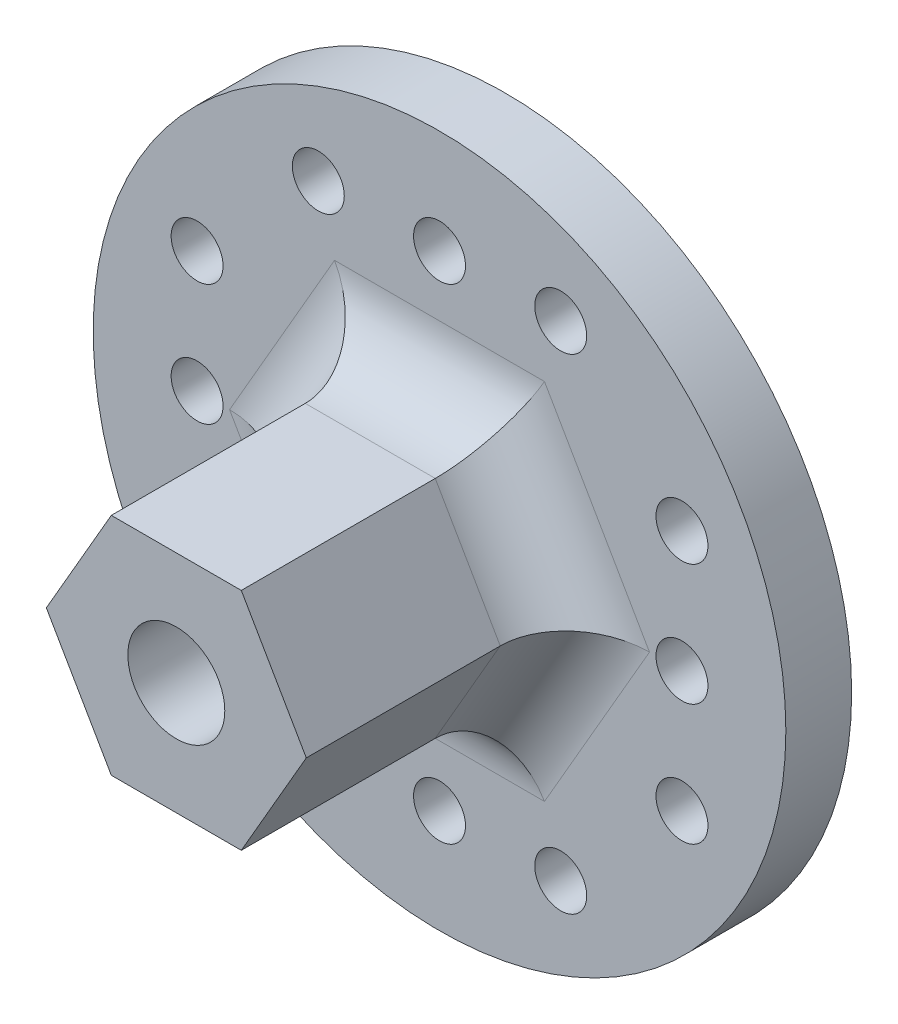
ISO-10303-21;
HEADER;
FILE_DESCRIPTION(('STEP AP214'),'2;1');
FILE_NAME('part.step','',(''),(''),'','','');
FILE_SCHEMA(('AUTOMOTIVE_DESIGN { 1 0 10303 214 1 1 1 1 }'));
ENDSEC;
DATA;
#1=APPLICATION_CONTEXT('core data for automotive mechanical design processes');
#2=APPLICATION_PROTOCOL_DEFINITION('international standard','automotive_design',2000,#1);
#3=PRODUCT_CONTEXT('',#1,'mechanical');
#4=PRODUCT('Part','Part','',(#3));
#5=PRODUCT_RELATED_PRODUCT_CATEGORY('part','',(#4));
#6=PRODUCT_DEFINITION_FORMATION('','',#4);
#7=PRODUCT_DEFINITION_CONTEXT('part definition',#1,'design');
#8=PRODUCT_DEFINITION('design','',#6,#7);
#9=PRODUCT_DEFINITION_SHAPE('','',#8);
#10=(LENGTH_UNIT() NAMED_UNIT(*) SI_UNIT(.MILLI.,.METRE.));
#11=(NAMED_UNIT(*) PLANE_ANGLE_UNIT() SI_UNIT($,.RADIAN.));
#12=(NAMED_UNIT(*) SI_UNIT($,.STERADIAN.) SOLID_ANGLE_UNIT());
#13=UNCERTAINTY_MEASURE_WITH_UNIT(LENGTH_MEASURE(1.E-05),#10,'distance_accuracy_value','');
#14=(GEOMETRIC_REPRESENTATION_CONTEXT(3) GLOBAL_UNCERTAINTY_ASSIGNED_CONTEXT((#13)) GLOBAL_UNIT_ASSIGNED_CONTEXT((#10,
#11,#12)) REPRESENTATION_CONTEXT('',''));
#15=CARTESIAN_POINT('',(0.,0.,0.));
#16=DIRECTION('',(0.,0.,1.));
#17=DIRECTION('',(1.,0.,0.));
#18=AXIS2_PLACEMENT_3D('',#15,#16,#17);
#19=CARTESIAN_POINT('',(0.,0.,1.9));
#20=DIRECTION('',(0.,0.,1.));
#21=DIRECTION('',(1.,0.,0.));
#22=AXIS2_PLACEMENT_3D('',#19,#20,#21);
#23=PLANE('',#22);
#24=DIRECTION('',(0.5,-0.866025403784439,0.));
#25=VECTOR('',#24,1.);
#26=CARTESIAN_POINT('',(-4.5466333698683,-2.625,1.9));
#27=LINE('',#26,#25);
#28=CARTESIAN_POINT('',(-3.03108891324553,-5.25,1.9));
#29=VERTEX_POINT('',#28);
#30=CARTESIAN_POINT('',(-6.06217782649107,0.,1.9));
#31=VERTEX_POINT('',#30);
#32=EDGE_CURVE('E223',#29,#31,#27,.F.);
#33=ORIENTED_EDGE('',*,*,#32,.T.);
#34=DIRECTION('',(-0.5,-0.866025403784439,0.));
#35=VECTOR('',#34,1.);
#36=CARTESIAN_POINT('',(-4.5466333698683,2.625,1.9));
#37=LINE('',#36,#35);
#38=CARTESIAN_POINT('',(-3.03108891324553,5.25,1.9));
#39=VERTEX_POINT('',#38);
#40=EDGE_CURVE('E225',#31,#39,#37,.F.);
#41=ORIENTED_EDGE('',*,*,#40,.T.);
#42=DIRECTION('',(-1.,0.,0.));
#43=VECTOR('',#42,1.);
#44=CARTESIAN_POINT('',(0.,5.25,1.9));
#45=LINE('',#44,#43);
#46=CARTESIAN_POINT('',(3.03108891324553,5.25,1.9));
#47=VERTEX_POINT('',#46);
#48=EDGE_CURVE('E215',#39,#47,#45,.F.);
#49=ORIENTED_EDGE('',*,*,#48,.T.);
#50=DIRECTION('',(-0.5,0.866025403784439,0.));
#51=VECTOR('',#50,1.);
#52=CARTESIAN_POINT('',(4.5466333698683,2.625,1.9));
#53=LINE('',#52,#51);
#54=CARTESIAN_POINT('',(6.06217782649107,0.,1.9));
#55=VERTEX_POINT('',#54);
#56=EDGE_CURVE('E217',#47,#55,#53,.F.);
#57=ORIENTED_EDGE('',*,*,#56,.T.);
#58=DIRECTION('',(0.5,0.866025403784439,0.));
#59=VECTOR('',#58,1.);
#60=CARTESIAN_POINT('',(4.5466333698683,-2.625,1.9));
#61=LINE('',#60,#59);
#62=CARTESIAN_POINT('',(3.03108891324554,-5.25,1.9));
#63=VERTEX_POINT('',#62);
#64=EDGE_CURVE('E219',#55,#63,#61,.F.);
#65=ORIENTED_EDGE('',*,*,#64,.T.);
#66=DIRECTION('',(1.,0.,0.));
#67=VECTOR('',#66,1.);
#68=CARTESIAN_POINT('',(0.,-5.25,1.9));
#69=LINE('',#68,#67);
#70=EDGE_CURVE('E221',#63,#29,#69,.F.);
#71=ORIENTED_EDGE('',*,*,#70,.T.);
#72=EDGE_LOOP('',(#33,#41,#49,#57,#65,#71));
#73=FACE_BOUND('',#72,.T.);
#74=CARTESIAN_POINT('',(3.5000000000003,-6.9999999999999,1.9));
#75=DIRECTION('',(0.,0.,1.));
#76=DIRECTION('',(1.,0.,0.));
#77=AXIS2_PLACEMENT_3D('',#74,#75,#76);
#78=CIRCLE('',#77,0.749999999999977);
#79=CARTESIAN_POINT('',(4.25000000000027,-6.9999999999999,1.9));
#80=VERTEX_POINT('',#79);
#81=EDGE_CURVE('E137',#80,#80,#78,.T.);
#82=ORIENTED_EDGE('',*,*,#81,.F.);
#83=EDGE_LOOP('',(#82));
#84=FACE_BOUND('',#83,.T.);
#85=CARTESIAN_POINT('',(-7.,-3.5,1.9));
#86=DIRECTION('',(0.,0.,1.));
#87=DIRECTION('',(1.,0.,0.));
#88=AXIS2_PLACEMENT_3D('',#85,#86,#87);
#89=CIRCLE('',#88,0.749999999999998);
#90=CARTESIAN_POINT('',(-6.25,-3.5,1.9));
#91=VERTEX_POINT('',#90);
#92=EDGE_CURVE('E149',#91,#91,#89,.T.);
#93=ORIENTED_EDGE('',*,*,#92,.F.);
#94=EDGE_LOOP('',(#93));
#95=FACE_BOUND('',#94,.T.);
#96=CARTESIAN_POINT('',(7.0000000000002,-3.49999999999961,1.9));
#97=DIRECTION('',(0.,0.,1.));
#98=DIRECTION('',(1.,0.,0.));
#99=AXIS2_PLACEMENT_3D('',#96,#97,#98);
#100=CIRCLE('',#99,0.750000000000342);
#101=CARTESIAN_POINT('',(7.75000000000054,-3.49999999999961,1.9));
#102=VERTEX_POINT('',#101);
#103=EDGE_CURVE('E161',#102,#102,#100,.T.);
#104=ORIENTED_EDGE('',*,*,#103,.F.);
#105=EDGE_LOOP('',(#104));
#106=FACE_BOUND('',#105,.T.);
#107=CARTESIAN_POINT('',(7.0000000000002,3.9377212006815E-13,1.9));
#108=DIRECTION('',(0.,0.,1.));
#109=DIRECTION('',(1.,0.,0.));
#110=AXIS2_PLACEMENT_3D('',#107,#108,#109);
#111=CIRCLE('',#110,0.750000000000319);
#112=CARTESIAN_POINT('',(7.75000000000052,3.9377212006815E-13,1.9));
#113=VERTEX_POINT('',#112);
#114=EDGE_CURVE('E173',#113,#113,#111,.T.);
#115=ORIENTED_EDGE('',*,*,#114,.F.);
#116=EDGE_LOOP('',(#115));
#117=FACE_BOUND('',#116,.T.);
#118=CARTESIAN_POINT('',(-3.5000000000001,7.00000000000029,1.9));
#119=DIRECTION('',(0.,0.,1.));
#120=DIRECTION('',(1.,0.,0.));
#121=AXIS2_PLACEMENT_3D('',#118,#119,#120);
#122=CIRCLE('',#121,0.750000000000305);
#123=CARTESIAN_POINT('',(-2.74999999999979,7.00000000000029,1.9));
#124=VERTEX_POINT('',#123);
#125=EDGE_CURVE('E185',#124,#124,#122,.T.);
#126=ORIENTED_EDGE('',*,*,#125,.F.);
#127=EDGE_LOOP('',(#126));
#128=FACE_BOUND('',#127,.T.);
#129=CARTESIAN_POINT('',(-7.,0.,1.9));
#130=DIRECTION('',(0.,0.,1.));
#131=DIRECTION('',(1.,0.,0.));
#132=AXIS2_PLACEMENT_3D('',#129,#130,#131);
#133=CIRCLE('',#132,0.749999999999998);
#134=CARTESIAN_POINT('',(-6.25,0.,1.9));
#135=VERTEX_POINT('',#134);
#136=EDGE_CURVE('E197',#135,#135,#133,.T.);
#137=ORIENTED_EDGE('',*,*,#136,.F.);
#138=EDGE_LOOP('',(#137));
#139=FACE_BOUND('',#138,.T.);
#140=CARTESIAN_POINT('',(0.,0.,1.9));
#141=DIRECTION('',(0.,0.,1.));
#142=DIRECTION('',(1.,0.,0.));
#143=AXIS2_PLACEMENT_3D('',#140,#141,#142);
#144=CIRCLE('',#143,9.99999999999866);
#145=CARTESIAN_POINT('',(9.99999999999866,0.,1.9));
#146=VERTEX_POINT('',#145);
#147=EDGE_CURVE('E203',#146,#146,#144,.T.);
#148=ORIENTED_EDGE('',*,*,#147,.T.);
#149=EDGE_LOOP('',(#148));
#150=FACE_BOUND('',#149,.T.);
#151=CARTESIAN_POINT('',(0.,7.0000000000003,1.9));
#152=DIRECTION('',(0.,0.,1.));
#153=DIRECTION('',(1.,0.,0.));
#154=AXIS2_PLACEMENT_3D('',#151,#152,#153);
#155=CIRCLE('',#154,0.750000000000317);
#156=CARTESIAN_POINT('',(0.75000000000022,7.0000000000003,1.9));
#157=VERTEX_POINT('',#156);
#158=EDGE_CURVE('E191',#157,#157,#155,.T.);
#159=ORIENTED_EDGE('',*,*,#158,.F.);
#160=EDGE_LOOP('',(#159));
#161=FACE_BOUND('',#160,.T.);
#162=CARTESIAN_POINT('',(3.4999999999999,7.0000000000003,1.9));
#163=DIRECTION('',(0.,0.,1.));
#164=DIRECTION('',(1.,0.,0.));
#165=AXIS2_PLACEMENT_3D('',#162,#163,#164);
#166=CIRCLE('',#165,0.750000000000329);
#167=CARTESIAN_POINT('',(4.25000000000023,7.0000000000003,1.9));
#168=VERTEX_POINT('',#167);
#169=EDGE_CURVE('E179',#168,#168,#166,.T.);
#170=ORIENTED_EDGE('',*,*,#169,.F.);
#171=EDGE_LOOP('',(#170));
#172=FACE_BOUND('',#171,.T.);
#173=CARTESIAN_POINT('',(7.0000000000002,3.50000000000039,1.9));
#174=DIRECTION('',(0.,0.,1.));
#175=DIRECTION('',(1.,0.,0.));
#176=AXIS2_PLACEMENT_3D('',#173,#174,#175);
#177=CIRCLE('',#176,0.750000000000295);
#178=CARTESIAN_POINT('',(7.75000000000049,3.50000000000039,1.9));
#179=VERTEX_POINT('',#178);
#180=EDGE_CURVE('E167',#179,#179,#177,.T.);
#181=ORIENTED_EDGE('',*,*,#180,.F.);
#182=EDGE_LOOP('',(#181));
#183=FACE_BOUND('',#182,.T.);
#184=CARTESIAN_POINT('',(2.97489912662145E-13,-6.9999999999999,1.9));
#185=DIRECTION('',(0.,0.,1.));
#186=DIRECTION('',(1.,0.,0.));
#187=AXIS2_PLACEMENT_3D('',#184,#185,#186);
#188=CIRCLE('',#187,0.750000000000013);
#189=CARTESIAN_POINT('',(0.750000000000311,-6.9999999999999,1.9));
#190=VERTEX_POINT('',#189);
#191=EDGE_CURVE('E155',#190,#190,#188,.T.);
#192=ORIENTED_EDGE('',*,*,#191,.F.);
#193=EDGE_LOOP('',(#192));
#194=FACE_BOUND('',#193,.T.);
#195=CARTESIAN_POINT('',(-7.,3.5,1.9));
#196=DIRECTION('',(0.,0.,1.));
#197=DIRECTION('',(1.,0.,0.));
#198=AXIS2_PLACEMENT_3D('',#195,#196,#197);
#199=CIRCLE('',#198,0.749999999999998);
#200=CARTESIAN_POINT('',(-6.25,3.5,1.9));
#201=VERTEX_POINT('',#200);
#202=EDGE_CURVE('E143',#201,#201,#199,.T.);
#203=ORIENTED_EDGE('',*,*,#202,.F.);
#204=EDGE_LOOP('',(#203));
#205=FACE_BOUND('',#204,.T.);
#206=CARTESIAN_POINT('',(-3.4999999999997,-6.9999999999999,1.9));
#207=DIRECTION('',(0.,0.,1.));
#208=DIRECTION('',(1.,0.,0.));
#209=AXIS2_PLACEMENT_3D('',#206,#207,#208);
#210=CIRCLE('',#209,0.750000000000049);
#211=CARTESIAN_POINT('',(-2.74999999999965,-6.9999999999999,1.9));
#212=VERTEX_POINT('',#211);
#213=EDGE_CURVE('E128',#212,#212,#210,.T.);
#214=ORIENTED_EDGE('',*,*,#213,.F.);
#215=EDGE_LOOP('',(#214));
#216=FACE_BOUND('',#215,.T.);
#217=ADVANCED_FACE('F35',(#73,#84,#95,#106,#117,#128,#139,#150,#161,#172,#183,#194,#205,#216),
#23,.T.);
#218=CARTESIAN_POINT('',(0.,0.,0.));
#219=DIRECTION('',(0.,0.,1.));
#220=DIRECTION('',(1.,0.,0.));
#221=AXIS2_PLACEMENT_3D('',#218,#219,#220);
#222=PLANE('',#221);
#223=CARTESIAN_POINT('',(0.,0.,0.));
#224=DIRECTION('',(0.,0.,1.));
#225=DIRECTION('',(1.,0.,0.));
#226=AXIS2_PLACEMENT_3D('',#223,#224,#225);
#227=CIRCLE('',#226,3.25);
#228=CARTESIAN_POINT('',(3.25,0.,0.));
#229=VERTEX_POINT('',#228);
#230=EDGE_CURVE('E209',#229,#229,#227,.T.);
#231=ORIENTED_EDGE('',*,*,#230,.T.);
#232=EDGE_LOOP('',(#231));
#233=FACE_BOUND('',#232,.T.);
#234=CARTESIAN_POINT('',(0.,0.,0.));
#235=DIRECTION('',(0.,0.,1.));
#236=DIRECTION('',(1.,0.,0.));
#237=AXIS2_PLACEMENT_3D('',#234,#235,#236);
#238=CIRCLE('',#237,9.99999999999866);
#239=CARTESIAN_POINT('',(9.99999999999866,0.,0.));
#240=VERTEX_POINT('',#239);
#241=EDGE_CURVE('E200',#240,#240,#238,.T.);
#242=ORIENTED_EDGE('',*,*,#241,.F.);
#243=EDGE_LOOP('',(#242));
#244=FACE_BOUND('',#243,.T.);
#245=CARTESIAN_POINT('',(-7.,0.,0.));
#246=DIRECTION('',(0.,0.,1.));
#247=DIRECTION('',(1.,0.,0.));
#248=AXIS2_PLACEMENT_3D('',#245,#246,#247);
#249=CIRCLE('',#248,0.749999999999998);
#250=CARTESIAN_POINT('',(-6.25,0.,0.));
#251=VERTEX_POINT('',#250);
#252=EDGE_CURVE('E194',#251,#251,#249,.T.);
#253=ORIENTED_EDGE('',*,*,#252,.T.);
#254=EDGE_LOOP('',(#253));
#255=FACE_BOUND('',#254,.T.);
#256=CARTESIAN_POINT('',(0.,7.0000000000003,0.));
#257=DIRECTION('',(0.,0.,1.));
#258=DIRECTION('',(1.,0.,0.));
#259=AXIS2_PLACEMENT_3D('',#256,#257,#258);
#260=CIRCLE('',#259,0.750000000000317);
#261=CARTESIAN_POINT('',(0.75000000000022,7.0000000000003,0.));
#262=VERTEX_POINT('',#261);
#263=EDGE_CURVE('E188',#262,#262,#260,.T.);
#264=ORIENTED_EDGE('',*,*,#263,.T.);
#265=EDGE_LOOP('',(#264));
#266=FACE_BOUND('',#265,.T.);
#267=CARTESIAN_POINT('',(-3.5000000000001,7.00000000000029,0.));
#268=DIRECTION('',(0.,0.,1.));
#269=DIRECTION('',(1.,0.,0.));
#270=AXIS2_PLACEMENT_3D('',#267,#268,#269);
#271=CIRCLE('',#270,0.750000000000305);
#272=CARTESIAN_POINT('',(-2.74999999999979,7.00000000000029,0.));
#273=VERTEX_POINT('',#272);
#274=EDGE_CURVE('E182',#273,#273,#271,.T.);
#275=ORIENTED_EDGE('',*,*,#274,.T.);
#276=EDGE_LOOP('',(#275));
#277=FACE_BOUND('',#276,.T.);
#278=CARTESIAN_POINT('',(3.4999999999999,7.0000000000003,0.));
#279=DIRECTION('',(0.,0.,1.));
#280=DIRECTION('',(1.,0.,0.));
#281=AXIS2_PLACEMENT_3D('',#278,#279,#280);
#282=CIRCLE('',#281,0.750000000000329);
#283=CARTESIAN_POINT('',(4.25000000000023,7.0000000000003,0.));
#284=VERTEX_POINT('',#283);
#285=EDGE_CURVE('E176',#284,#284,#282,.T.);
#286=ORIENTED_EDGE('',*,*,#285,.T.);
#287=EDGE_LOOP('',(#286));
#288=FACE_BOUND('',#287,.T.);
#289=CARTESIAN_POINT('',(7.0000000000002,3.9377212006815E-13,0.));
#290=DIRECTION('',(0.,0.,1.));
#291=DIRECTION('',(1.,0.,0.));
#292=AXIS2_PLACEMENT_3D('',#289,#290,#291);
#293=CIRCLE('',#292,0.750000000000319);
#294=CARTESIAN_POINT('',(7.75000000000052,3.9377212006815E-13,0.));
#295=VERTEX_POINT('',#294);
#296=EDGE_CURVE('E170',#295,#295,#293,.T.);
#297=ORIENTED_EDGE('',*,*,#296,.T.);
#298=EDGE_LOOP('',(#297));
#299=FACE_BOUND('',#298,.T.);
#300=CARTESIAN_POINT('',(7.0000000000002,3.50000000000039,0.));
#301=DIRECTION('',(0.,0.,1.));
#302=DIRECTION('',(1.,0.,0.));
#303=AXIS2_PLACEMENT_3D('',#300,#301,#302);
#304=CIRCLE('',#303,0.750000000000295);
#305=CARTESIAN_POINT('',(7.75000000000049,3.50000000000039,0.));
#306=VERTEX_POINT('',#305);
#307=EDGE_CURVE('E164',#306,#306,#304,.T.);
#308=ORIENTED_EDGE('',*,*,#307,.T.);
#309=EDGE_LOOP('',(#308));
#310=FACE_BOUND('',#309,.T.);
#311=CARTESIAN_POINT('',(7.0000000000002,-3.49999999999961,0.));
#312=DIRECTION('',(0.,0.,1.));
#313=DIRECTION('',(1.,0.,0.));
#314=AXIS2_PLACEMENT_3D('',#311,#312,#313);
#315=CIRCLE('',#314,0.750000000000342);
#316=CARTESIAN_POINT('',(7.75000000000054,-3.49999999999961,0.));
#317=VERTEX_POINT('',#316);
#318=EDGE_CURVE('E158',#317,#317,#315,.T.);
#319=ORIENTED_EDGE('',*,*,#318,.T.);
#320=EDGE_LOOP('',(#319));
#321=FACE_BOUND('',#320,.T.);
#322=CARTESIAN_POINT('',(2.97489912662145E-13,-6.9999999999999,0.));
#323=DIRECTION('',(0.,0.,1.));
#324=DIRECTION('',(1.,0.,0.));
#325=AXIS2_PLACEMENT_3D('',#322,#323,#324);
#326=CIRCLE('',#325,0.750000000000013);
#327=CARTESIAN_POINT('',(0.750000000000311,-6.9999999999999,0.));
#328=VERTEX_POINT('',#327);
#329=EDGE_CURVE('E152',#328,#328,#326,.T.);
#330=ORIENTED_EDGE('',*,*,#329,.T.);
#331=EDGE_LOOP('',(#330));
#332=FACE_BOUND('',#331,.T.);
#333=CARTESIAN_POINT('',(-7.,-3.5,0.));
#334=DIRECTION('',(0.,0.,1.));
#335=DIRECTION('',(1.,0.,0.));
#336=AXIS2_PLACEMENT_3D('',#333,#334,#335);
#337=CIRCLE('',#336,0.749999999999998);
#338=CARTESIAN_POINT('',(-6.25,-3.5,0.));
#339=VERTEX_POINT('',#338);
#340=EDGE_CURVE('E146',#339,#339,#337,.T.);
#341=ORIENTED_EDGE('',*,*,#340,.T.);
#342=EDGE_LOOP('',(#341));
#343=FACE_BOUND('',#342,.T.);
#344=CARTESIAN_POINT('',(-7.,3.5,0.));
#345=DIRECTION('',(0.,0.,1.));
#346=DIRECTION('',(1.,0.,0.));
#347=AXIS2_PLACEMENT_3D('',#344,#345,#346);
#348=CIRCLE('',#347,0.749999999999998);
#349=CARTESIAN_POINT('',(-6.25,3.5,0.));
#350=VERTEX_POINT('',#349);
#351=EDGE_CURVE('E140',#350,#350,#348,.T.);
#352=ORIENTED_EDGE('',*,*,#351,.T.);
#353=EDGE_LOOP('',(#352));
#354=FACE_BOUND('',#353,.T.);
#355=CARTESIAN_POINT('',(3.5000000000003,-6.9999999999999,0.));
#356=DIRECTION('',(0.,0.,1.));
#357=DIRECTION('',(1.,0.,0.));
#358=AXIS2_PLACEMENT_3D('',#355,#356,#357);
#359=CIRCLE('',#358,0.749999999999977);
#360=CARTESIAN_POINT('',(4.25000000000027,-6.9999999999999,0.));
#361=VERTEX_POINT('',#360);
#362=EDGE_CURVE('E135',#361,#361,#359,.T.);
#363=ORIENTED_EDGE('',*,*,#362,.T.);
#364=EDGE_LOOP('',(#363));
#365=FACE_BOUND('',#364,.T.);
#366=CARTESIAN_POINT('',(-3.4999999999997,-6.9999999999999,0.));
#367=DIRECTION('',(0.,0.,1.));
#368=DIRECTION('',(1.,0.,0.));
#369=AXIS2_PLACEMENT_3D('',#366,#367,#368);
#370=CIRCLE('',#369,0.750000000000049);
#371=CARTESIAN_POINT('',(-2.74999999999965,-6.9999999999999,0.));
#372=VERTEX_POINT('',#371);
#373=EDGE_CURVE('E125',#372,#372,#370,.T.);
#374=ORIENTED_EDGE('',*,*,#373,.T.);
#375=EDGE_LOOP('',(#374));
#376=FACE_BOUND('',#375,.T.);
#377=ADVANCED_FACE('F312',(#233,#244,#255,#266,#277,#288,#299,#310,#321,#332,#343,#354,#365,
#376),#222,.F.);
#378=CARTESIAN_POINT('',(0.,0.,1.9));
#379=DIRECTION('',(0.,0.,-1.));
#380=DIRECTION('',(-1.,0.,0.));
#381=AXIS2_PLACEMENT_3D('',#378,#379,#380);
#382=CYLINDRICAL_SURFACE('',#381,9.99999999999866);
#383=ORIENTED_EDGE('',*,*,#147,.F.);
#384=EDGE_LOOP('',(#383));
#385=FACE_BOUND('',#384,.T.);
#386=ORIENTED_EDGE('',*,*,#241,.T.);
#387=EDGE_LOOP('',(#386));
#388=FACE_BOUND('',#387,.T.);
#389=ADVANCED_FACE('F317',(#385,#388),#382,.T.);
#390=CARTESIAN_POINT('',(-7.,0.,1.9));
#391=DIRECTION('',(0.,0.,-1.));
#392=DIRECTION('',(-1.,0.,0.));
#393=AXIS2_PLACEMENT_3D('',#390,#391,#392);
#394=CYLINDRICAL_SURFACE('',#393,0.749999999999998);
#395=ORIENTED_EDGE('',*,*,#136,.T.);
#396=EDGE_LOOP('',(#395));
#397=FACE_BOUND('',#396,.T.);
#398=ORIENTED_EDGE('',*,*,#252,.F.);
#399=EDGE_LOOP('',(#398));
#400=FACE_BOUND('',#399,.T.);
#401=ADVANCED_FACE('F321',(#397,#400),#394,.F.);
#402=CARTESIAN_POINT('',(0.,7.0000000000003,1.9));
#403=DIRECTION('',(0.,0.,-1.));
#404=DIRECTION('',(-1.,0.,0.));
#405=AXIS2_PLACEMENT_3D('',#402,#403,#404);
#406=CYLINDRICAL_SURFACE('',#405,0.750000000000317);
#407=ORIENTED_EDGE('',*,*,#158,.T.);
#408=EDGE_LOOP('',(#407));
#409=FACE_BOUND('',#408,.T.);
#410=ORIENTED_EDGE('',*,*,#263,.F.);
#411=EDGE_LOOP('',(#410));
#412=FACE_BOUND('',#411,.T.);
#413=ADVANCED_FACE('F425',(#409,#412),#406,.F.);
#414=CARTESIAN_POINT('',(-3.5000000000001,7.00000000000029,1.9));
#415=DIRECTION('',(0.,0.,-1.));
#416=DIRECTION('',(-1.,0.,0.));
#417=AXIS2_PLACEMENT_3D('',#414,#415,#416);
#418=CYLINDRICAL_SURFACE('',#417,0.750000000000305);
#419=ORIENTED_EDGE('',*,*,#125,.T.);
#420=EDGE_LOOP('',(#419));
#421=FACE_BOUND('',#420,.T.);
#422=ORIENTED_EDGE('',*,*,#274,.F.);
#423=EDGE_LOOP('',(#422));
#424=FACE_BOUND('',#423,.T.);
#425=ADVANCED_FACE('F422',(#421,#424),#418,.F.);
#426=CARTESIAN_POINT('',(3.4999999999999,7.0000000000003,1.9));
#427=DIRECTION('',(0.,0.,-1.));
#428=DIRECTION('',(-1.,0.,0.));
#429=AXIS2_PLACEMENT_3D('',#426,#427,#428);
#430=CYLINDRICAL_SURFACE('',#429,0.750000000000329);
#431=ORIENTED_EDGE('',*,*,#169,.T.);
#432=EDGE_LOOP('',(#431));
#433=FACE_BOUND('',#432,.T.);
#434=ORIENTED_EDGE('',*,*,#285,.F.);
#435=EDGE_LOOP('',(#434));
#436=FACE_BOUND('',#435,.T.);
#437=ADVANCED_FACE('F418',(#433,#436),#430,.F.);
#438=CARTESIAN_POINT('',(7.0000000000002,3.9377212006815E-13,1.9));
#439=DIRECTION('',(0.,0.,-1.));
#440=DIRECTION('',(-1.,0.,0.));
#441=AXIS2_PLACEMENT_3D('',#438,#439,#440);
#442=CYLINDRICAL_SURFACE('',#441,0.750000000000319);
#443=ORIENTED_EDGE('',*,*,#114,.T.);
#444=EDGE_LOOP('',(#443));
#445=FACE_BOUND('',#444,.T.);
#446=ORIENTED_EDGE('',*,*,#296,.F.);
#447=EDGE_LOOP('',(#446));
#448=FACE_BOUND('',#447,.T.);
#449=ADVANCED_FACE('F414',(#445,#448),#442,.F.);
#450=CARTESIAN_POINT('',(7.0000000000002,3.50000000000039,1.9));
#451=DIRECTION('',(0.,0.,-1.));
#452=DIRECTION('',(-1.,0.,0.));
#453=AXIS2_PLACEMENT_3D('',#450,#451,#452);
#454=CYLINDRICAL_SURFACE('',#453,0.750000000000295);
#455=ORIENTED_EDGE('',*,*,#180,.T.);
#456=EDGE_LOOP('',(#455));
#457=FACE_BOUND('',#456,.T.);
#458=ORIENTED_EDGE('',*,*,#307,.F.);
#459=EDGE_LOOP('',(#458));
#460=FACE_BOUND('',#459,.T.);
#461=ADVANCED_FACE('F410',(#457,#460),#454,.F.);
#462=CARTESIAN_POINT('',(7.0000000000002,-3.49999999999961,1.9));
#463=DIRECTION('',(0.,0.,-1.));
#464=DIRECTION('',(-1.,0.,0.));
#465=AXIS2_PLACEMENT_3D('',#462,#463,#464);
#466=CYLINDRICAL_SURFACE('',#465,0.750000000000342);
#467=ORIENTED_EDGE('',*,*,#103,.T.);
#468=EDGE_LOOP('',(#467));
#469=FACE_BOUND('',#468,.T.);
#470=ORIENTED_EDGE('',*,*,#318,.F.);
#471=EDGE_LOOP('',(#470));
#472=FACE_BOUND('',#471,.T.);
#473=ADVANCED_FACE('F406',(#469,#472),#466,.F.);
#474=CARTESIAN_POINT('',(2.97489912662145E-13,-6.9999999999999,1.9));
#475=DIRECTION('',(0.,0.,-1.));
#476=DIRECTION('',(-1.,0.,0.));
#477=AXIS2_PLACEMENT_3D('',#474,#475,#476);
#478=CYLINDRICAL_SURFACE('',#477,0.750000000000013);
#479=ORIENTED_EDGE('',*,*,#191,.T.);
#480=EDGE_LOOP('',(#479));
#481=FACE_BOUND('',#480,.T.);
#482=ORIENTED_EDGE('',*,*,#329,.F.);
#483=EDGE_LOOP('',(#482));
#484=FACE_BOUND('',#483,.T.);
#485=ADVANCED_FACE('F402',(#481,#484),#478,.F.);
#486=CARTESIAN_POINT('',(-7.,-3.5,1.9));
#487=DIRECTION('',(0.,0.,-1.));
#488=DIRECTION('',(-1.,0.,0.));
#489=AXIS2_PLACEMENT_3D('',#486,#487,#488);
#490=CYLINDRICAL_SURFACE('',#489,0.749999999999998);
#491=ORIENTED_EDGE('',*,*,#92,.T.);
#492=EDGE_LOOP('',(#491));
#493=FACE_BOUND('',#492,.T.);
#494=ORIENTED_EDGE('',*,*,#340,.F.);
#495=EDGE_LOOP('',(#494));
#496=FACE_BOUND('',#495,.T.);
#497=ADVANCED_FACE('F398',(#493,#496),#490,.F.);
#498=CARTESIAN_POINT('',(-7.,3.5,1.9));
#499=DIRECTION('',(0.,0.,-1.));
#500=DIRECTION('',(-1.,0.,0.));
#501=AXIS2_PLACEMENT_3D('',#498,#499,#500);
#502=CYLINDRICAL_SURFACE('',#501,0.749999999999998);
#503=ORIENTED_EDGE('',*,*,#202,.T.);
#504=EDGE_LOOP('',(#503));
#505=FACE_BOUND('',#504,.T.);
#506=ORIENTED_EDGE('',*,*,#351,.F.);
#507=EDGE_LOOP('',(#506));
#508=FACE_BOUND('',#507,.T.);
#509=ADVANCED_FACE('F391',(#505,#508),#502,.F.);
#510=CARTESIAN_POINT('',(3.5000000000003,-6.9999999999999,1.9));
#511=DIRECTION('',(0.,0.,-1.));
#512=DIRECTION('',(-1.,0.,0.));
#513=AXIS2_PLACEMENT_3D('',#510,#511,#512);
#514=CYLINDRICAL_SURFACE('',#513,0.749999999999977);
#515=ORIENTED_EDGE('',*,*,#81,.T.);
#516=EDGE_LOOP('',(#515));
#517=FACE_BOUND('',#516,.T.);
#518=ORIENTED_EDGE('',*,*,#362,.F.);
#519=EDGE_LOOP('',(#518));
#520=FACE_BOUND('',#519,.T.);
#521=ADVANCED_FACE('F383',(#517,#520),#514,.F.);
#522=CARTESIAN_POINT('',(-3.4999999999997,-6.9999999999999,1.9));
#523=DIRECTION('',(0.,0.,-1.));
#524=DIRECTION('',(-1.,0.,0.));
#525=AXIS2_PLACEMENT_3D('',#522,#523,#524);
#526=CYLINDRICAL_SURFACE('',#525,0.750000000000049);
#527=ORIENTED_EDGE('',*,*,#213,.T.);
#528=EDGE_LOOP('',(#527));
#529=FACE_BOUND('',#528,.T.);
#530=ORIENTED_EDGE('',*,*,#373,.F.);
#531=EDGE_LOOP('',(#530));
#532=FACE_BOUND('',#531,.T.);
#533=ADVANCED_FACE('F381',(#529,#532),#526,.F.);
#534=CARTESIAN_POINT('',(1.87638837486628,-3.25,9.5));
#535=DIRECTION('',(-0.866025403784439,0.5,0.));
#536=DIRECTION('',(-0.5,-0.866025403784439,0.));
#537=AXIS2_PLACEMENT_3D('',#534,#535,#536);
#538=PLANE('',#537);
#539=DIRECTION('',(0.,0.,-1.));
#540=VECTOR('',#539,1.);
#541=CARTESIAN_POINT('',(1.87638837486628,-3.25,9.5));
#542=LINE('',#541,#540);
#543=CARTESIAN_POINT('',(1.87638837486628,-3.25,9.5));
#544=VERTEX_POINT('',#543);
#545=CARTESIAN_POINT('',(1.87638837486628,-3.25,3.9));
#546=VERTEX_POINT('',#545);
#547=EDGE_CURVE('E282',#544,#546,#542,.T.);
#548=ORIENTED_EDGE('',*,*,#547,.T.);
#549=DIRECTION('',(0.5,0.866025403784439,0.));
#550=VECTOR('',#549,1.);
#551=CARTESIAN_POINT('',(1.87638837486628,-3.25,3.9));
#552=LINE('',#551,#550);
#553=CARTESIAN_POINT('',(3.75277674973257,0.,3.9));
#554=VERTEX_POINT('',#553);
#555=EDGE_CURVE('E59',#546,#554,#552,.T.);
#556=ORIENTED_EDGE('',*,*,#555,.T.);
#557=DIRECTION('',(0.,0.,-1.));
#558=VECTOR('',#557,1.);
#559=CARTESIAN_POINT('',(3.75277674973257,0.,9.5));
#560=LINE('',#559,#558);
#561=CARTESIAN_POINT('',(3.75277674973257,0.,9.5));
#562=VERTEX_POINT('',#561);
#563=EDGE_CURVE('E109',#562,#554,#560,.T.);
#564=ORIENTED_EDGE('',*,*,#563,.F.);
#565=DIRECTION('',(0.5,0.866025403784439,0.));
#566=VECTOR('',#565,1.);
#567=CARTESIAN_POINT('',(1.87638837486628,-3.25,9.5));
#568=LINE('',#567,#566);
#569=EDGE_CURVE('E115',#544,#562,#568,.T.);
#570=ORIENTED_EDGE('',*,*,#569,.F.);
#571=EDGE_LOOP('',(#548,#556,#564,#570));
#572=FACE_BOUND('',#571,.T.);
#573=ADVANCED_FACE('F124',(#572),#538,.F.);
#574=CARTESIAN_POINT('',(3.75277674973257,0.,9.5));
#575=DIRECTION('',(-0.866025403784439,-0.5,0.));
#576=DIRECTION('',(0.5,-0.866025403784439,0.));
#577=AXIS2_PLACEMENT_3D('',#574,#575,#576);
#578=PLANE('',#577);
#579=ORIENTED_EDGE('',*,*,#563,.T.);
#580=DIRECTION('',(-0.5,0.866025403784439,0.));
#581=VECTOR('',#580,1.);
#582=CARTESIAN_POINT('',(3.75277674973257,0.,3.9));
#583=LINE('',#582,#581);
#584=CARTESIAN_POINT('',(1.87638837486628,3.25,3.9));
#585=VERTEX_POINT('',#584);
#586=EDGE_CURVE('E44',#554,#585,#583,.T.);
#587=ORIENTED_EDGE('',*,*,#586,.T.);
#588=DIRECTION('',(0.,0.,-1.));
#589=VECTOR('',#588,1.);
#590=CARTESIAN_POINT('',(1.87638837486628,3.25,9.5));
#591=LINE('',#590,#589);
#592=CARTESIAN_POINT('',(1.87638837486628,3.25,9.5));
#593=VERTEX_POINT('',#592);
#594=EDGE_CURVE('E111',#593,#585,#591,.T.);
#595=ORIENTED_EDGE('',*,*,#594,.F.);
#596=DIRECTION('',(-0.5,0.866025403784439,0.));
#597=VECTOR('',#596,1.);
#598=CARTESIAN_POINT('',(3.75277674973257,0.,9.5));
#599=LINE('',#598,#597);
#600=EDGE_CURVE('E106',#562,#593,#599,.T.);
#601=ORIENTED_EDGE('',*,*,#600,.F.);
#602=EDGE_LOOP('',(#579,#587,#595,#601));
#603=FACE_BOUND('',#602,.T.);
#604=ADVANCED_FACE('F108',(#603),#578,.F.);
#605=CARTESIAN_POINT('',(1.87638837486628,3.25,9.5));
#606=DIRECTION('',(0.,-1.,0.));
#607=DIRECTION('',(1.,0.,0.));
#608=AXIS2_PLACEMENT_3D('',#605,#606,#607);
#609=PLANE('',#608);
#610=ORIENTED_EDGE('',*,*,#594,.T.);
#611=DIRECTION('',(-1.,0.,0.));
#612=VECTOR('',#611,1.);
#613=CARTESIAN_POINT('',(1.87638837486628,3.25,3.9));
#614=LINE('',#613,#612);
#615=CARTESIAN_POINT('',(-1.87638837486628,3.25,3.9));
#616=VERTEX_POINT('',#615);
#617=EDGE_CURVE('E11',#585,#616,#614,.T.);
#618=ORIENTED_EDGE('',*,*,#617,.T.);
#619=DIRECTION('',(0.,0.,-1.));
#620=VECTOR('',#619,1.);
#621=CARTESIAN_POINT('',(-1.87638837486628,3.25,9.5));
#622=LINE('',#621,#620);
#623=CARTESIAN_POINT('',(-1.87638837486628,3.25,9.5));
#624=VERTEX_POINT('',#623);
#625=EDGE_CURVE('E130',#624,#616,#622,.T.);
#626=ORIENTED_EDGE('',*,*,#625,.F.);
#627=DIRECTION('',(-1.,0.,0.));
#628=VECTOR('',#627,1.);
#629=CARTESIAN_POINT('',(1.87638837486628,3.25,9.5));
#630=LINE('',#629,#628);
#631=EDGE_CURVE('E114',#593,#624,#630,.T.);
#632=ORIENTED_EDGE('',*,*,#631,.F.);
#633=EDGE_LOOP('',(#610,#618,#626,#632));
#634=FACE_BOUND('',#633,.T.);
#635=ADVANCED_FACE('F269',(#634),#609,.F.);
#636=CARTESIAN_POINT('',(-1.87638837486628,3.25,9.5));
#637=DIRECTION('',(0.866025403784439,-0.5,0.));
#638=DIRECTION('',(0.5,0.866025403784439,0.));
#639=AXIS2_PLACEMENT_3D('',#636,#637,#638);
#640=PLANE('',#639);
#641=ORIENTED_EDGE('',*,*,#625,.T.);
#642=DIRECTION('',(-0.5,-0.866025403784439,0.));
#643=VECTOR('',#642,1.);
#644=CARTESIAN_POINT('',(-1.87638837486628,3.25,3.9));
#645=LINE('',#644,#643);
#646=CARTESIAN_POINT('',(-3.75277674973257,0.,3.9));
#647=VERTEX_POINT('',#646);
#648=EDGE_CURVE('E206',#616,#647,#645,.T.);
#649=ORIENTED_EDGE('',*,*,#648,.T.);
#650=DIRECTION('',(0.,0.,-1.));
#651=VECTOR('',#650,1.);
#652=CARTESIAN_POINT('',(-3.75277674973257,0.,9.5));
#653=LINE('',#652,#651);
#654=CARTESIAN_POINT('',(-3.75277674973257,0.,9.5));
#655=VERTEX_POINT('',#654);
#656=EDGE_CURVE('E276',#655,#647,#653,.T.);
#657=ORIENTED_EDGE('',*,*,#656,.F.);
#658=DIRECTION('',(-0.5,-0.866025403784439,0.));
#659=VECTOR('',#658,1.);
#660=CARTESIAN_POINT('',(-1.87638837486628,3.25,9.5));
#661=LINE('',#660,#659);
#662=EDGE_CURVE('E275',#624,#655,#661,.T.);
#663=ORIENTED_EDGE('',*,*,#662,.F.);
#664=EDGE_LOOP('',(#641,#649,#657,#663));
#665=FACE_BOUND('',#664,.T.);
#666=ADVANCED_FACE('F272',(#665),#640,.F.);
#667=CARTESIAN_POINT('',(-3.75277674973257,0.,9.5));
#668=DIRECTION('',(0.866025403784438,0.5,0.));
#669=DIRECTION('',(-0.5,0.866025403784439,0.));
#670=AXIS2_PLACEMENT_3D('',#667,#668,#669);
#671=PLANE('',#670);
#672=ORIENTED_EDGE('',*,*,#656,.T.);
#673=DIRECTION('',(0.5,-0.866025403784439,0.));
#674=VECTOR('',#673,1.);
#675=CARTESIAN_POINT('',(-3.75277674973257,0.,3.9));
#676=LINE('',#675,#674);
#677=CARTESIAN_POINT('',(-1.87638837486628,-3.25,3.9));
#678=VERTEX_POINT('',#677);
#679=EDGE_CURVE('E228',#647,#678,#676,.T.);
#680=ORIENTED_EDGE('',*,*,#679,.T.);
#681=DIRECTION('',(0.,0.,-1.));
#682=VECTOR('',#681,1.);
#683=CARTESIAN_POINT('',(-1.87638837486628,-3.25,9.5));
#684=LINE('',#683,#682);
#685=CARTESIAN_POINT('',(-1.87638837486628,-3.25,9.5));
#686=VERTEX_POINT('',#685);
#687=EDGE_CURVE('E277',#686,#678,#684,.T.);
#688=ORIENTED_EDGE('',*,*,#687,.F.);
#689=DIRECTION('',(0.5,-0.866025403784439,0.));
#690=VECTOR('',#689,1.);
#691=CARTESIAN_POINT('',(-3.75277674973257,0.,9.5));
#692=LINE('',#691,#690);
#693=EDGE_CURVE('E285',#655,#686,#692,.T.);
#694=ORIENTED_EDGE('',*,*,#693,.F.);
#695=EDGE_LOOP('',(#672,#680,#688,#694));
#696=FACE_BOUND('',#695,.T.);
#697=ADVANCED_FACE('F308',(#696),#671,.F.);
#698=CARTESIAN_POINT('',(-1.87638837486628,-3.25,9.5));
#699=DIRECTION('',(0.,1.,0.));
#700=DIRECTION('',(0.,0.,1.));
#701=AXIS2_PLACEMENT_3D('',#698,#699,#700);
#702=PLANE('',#701);
#703=ORIENTED_EDGE('',*,*,#687,.T.);
#704=DIRECTION('',(1.,0.,0.));
#705=VECTOR('',#704,1.);
#706=CARTESIAN_POINT('',(-1.87638837486628,-3.25,3.9));
#707=LINE('',#706,#705);
#708=EDGE_CURVE('E230',#678,#546,#707,.T.);
#709=ORIENTED_EDGE('',*,*,#708,.T.);
#710=ORIENTED_EDGE('',*,*,#547,.F.);
#711=DIRECTION('',(1.,0.,0.));
#712=VECTOR('',#711,1.);
#713=CARTESIAN_POINT('',(-1.87638837486628,-3.25,9.5));
#714=LINE('',#713,#712);
#715=EDGE_CURVE('E120',#686,#544,#714,.T.);
#716=ORIENTED_EDGE('',*,*,#715,.F.);
#717=EDGE_LOOP('',(#703,#709,#710,#716));
#718=FACE_BOUND('',#717,.T.);
#719=ADVANCED_FACE('F303',(#718),#702,.F.);
#720=CARTESIAN_POINT('',(0.,0.,9.5));
#721=DIRECTION('',(0.,0.,1.));
#722=DIRECTION('',(1.,0.,0.));
#723=AXIS2_PLACEMENT_3D('',#720,#721,#722);
#724=PLANE('',#723);
#725=CARTESIAN_POINT('',(0.,0.,9.5));
#726=DIRECTION('',(0.,0.,1.));
#727=DIRECTION('',(1.,0.,0.));
#728=AXIS2_PLACEMENT_3D('',#725,#726,#727);
#729=CIRCLE('',#728,1.4);
#730=CARTESIAN_POINT('',(1.4,0.,9.5));
#731=VERTEX_POINT('',#730);
#732=EDGE_CURVE('E212',#731,#731,#729,.T.);
#733=ORIENTED_EDGE('',*,*,#732,.F.);
#734=EDGE_LOOP('',(#733));
#735=FACE_BOUND('',#734,.T.);
#736=ORIENTED_EDGE('',*,*,#569,.T.);
#737=ORIENTED_EDGE('',*,*,#600,.T.);
#738=ORIENTED_EDGE('',*,*,#631,.T.);
#739=ORIENTED_EDGE('',*,*,#662,.T.);
#740=ORIENTED_EDGE('',*,*,#693,.T.);
#741=ORIENTED_EDGE('',*,*,#715,.T.);
#742=EDGE_LOOP('',(#736,#737,#738,#739,#740,#741));
#743=FACE_BOUND('',#742,.T.);
#744=ADVANCED_FACE('F118',(#735,#743),#724,.T.);
#745=CARTESIAN_POINT('',(0.,0.,4.5));
#746=DIRECTION('',(0.,0.,1.));
#747=DIRECTION('',(1.,0.,0.));
#748=AXIS2_PLACEMENT_3D('',#745,#746,#747);
#749=CYLINDRICAL_SURFACE('',#748,1.4);
#750=CARTESIAN_POINT('',(0.,0.,4.5));
#751=DIRECTION('',(0.,0.,1.));
#752=DIRECTION('',(1.,0.,0.));
#753=AXIS2_PLACEMENT_3D('',#750,#751,#752);
#754=CIRCLE('',#753,1.4);
#755=CARTESIAN_POINT('',(1.4,0.,4.5));
#756=VERTEX_POINT('',#755);
#757=EDGE_CURVE('E122',#756,#756,#754,.T.);
#758=ORIENTED_EDGE('',*,*,#757,.F.);
#759=EDGE_LOOP('',(#758));
#760=FACE_BOUND('',#759,.T.);
#761=ORIENTED_EDGE('',*,*,#732,.T.);
#762=EDGE_LOOP('',(#761));
#763=FACE_BOUND('',#762,.T.);
#764=ADVANCED_FACE('F296',(#760,#763),#749,.F.);
#765=CARTESIAN_POINT('',(0.,0.,4.5));
#766=DIRECTION('',(0.,0.,1.));
#767=DIRECTION('',(1.,0.,0.));
#768=AXIS2_PLACEMENT_3D('',#765,#766,#767);
#769=PLANE('',#768);
#770=ORIENTED_EDGE('',*,*,#757,.T.);
#771=EDGE_LOOP('',(#770));
#772=FACE_BOUND('',#771,.T.);
#773=ADVANCED_FACE('F294',(#772),#769,.T.);
#774=CARTESIAN_POINT('',(0.,0.,0.));
#775=DIRECTION('',(1.,0.,0.));
#776=DIRECTION('',(0.,1.,0.));
#777=AXIS2_PLACEMENT_3D('',#774,#775,#776);
#778=SPHERICAL_SURFACE('',#777,3.25);
#779=CARTESIAN_POINT('',(0.,0.,0.));
#780=DIRECTION('',(0.,0.,1.));
#781=DIRECTION('',(1.,0.,0.));
#782=AXIS2_PLACEMENT_3D('',#779,#780,#781);
#783=SPHERICAL_SURFACE('',#782,3.25);
#784=ORIENTED_EDGE('',*,*,#230,.F.);
#785=EDGE_LOOP('',(#784));
#786=FACE_BOUND('',#785,.T.);
#787=ADVANCED_FACE('F343',(#786),#783,.F.);
#788=CARTESIAN_POINT('',(3.60843918243516,-4.25,3.9));
#789=DIRECTION('',(0.5,0.866025403784439,0.));
#790=DIRECTION('',(-0.866025403784439,0.5,0.));
#791=AXIS2_PLACEMENT_3D('',#788,#789,#790);
#792=CYLINDRICAL_SURFACE('',#791,2.);
#793=CARTESIAN_POINT('',(3.03108891324554,-5.25,3.9));
#794=DIRECTION('',(0.866025403784438,0.5,0.));
#795=DIRECTION('',(-0.5,0.866025403784439,0.));
#796=AXIS2_PLACEMENT_3D('',#793,#794,#795);
#797=ELLIPSE('',#796,2.3094010767585,2.);
#798=EDGE_CURVE('E243',#63,#546,#797,.T.);
#799=ORIENTED_EDGE('',*,*,#798,.F.);
#800=ORIENTED_EDGE('',*,*,#64,.F.);
#801=CARTESIAN_POINT('',(6.06217782649107,0.,3.9));
#802=DIRECTION('',(0.,1.,0.));
#803=DIRECTION('',(-1.,0.,0.));
#804=AXIS2_PLACEMENT_3D('',#801,#802,#803);
#805=ELLIPSE('',#804,2.3094010767585,2.);
#806=EDGE_CURVE('E39',#554,#55,#805,.F.);
#807=ORIENTED_EDGE('',*,*,#806,.F.);
#808=ORIENTED_EDGE('',*,*,#555,.F.);
#809=EDGE_LOOP('',(#799,#800,#807,#808));
#810=FACE_BOUND('',#809,.T.);
#811=ADVANCED_FACE('F37',(#810),#792,.F.);
#812=CARTESIAN_POINT('',(5.48482755730144,1.,3.9));
#813=DIRECTION('',(-0.5,0.866025403784439,0.));
#814=DIRECTION('',(-0.866025403784439,-0.5,0.));
#815=AXIS2_PLACEMENT_3D('',#812,#813,#814);
#816=CYLINDRICAL_SURFACE('',#815,2.);
#817=ORIENTED_EDGE('',*,*,#806,.T.);
#818=ORIENTED_EDGE('',*,*,#56,.F.);
#819=CARTESIAN_POINT('',(3.03108891324553,5.25,3.9));
#820=DIRECTION('',(-0.866025403784439,0.5,0.));
#821=DIRECTION('',(-0.5,-0.866025403784439,0.));
#822=AXIS2_PLACEMENT_3D('',#819,#820,#821);
#823=ELLIPSE('',#822,2.3094010767585,2.);
#824=EDGE_CURVE('E241',#585,#47,#823,.F.);
#825=ORIENTED_EDGE('',*,*,#824,.F.);
#826=ORIENTED_EDGE('',*,*,#586,.F.);
#827=EDGE_LOOP('',(#817,#818,#825,#826));
#828=FACE_BOUND('',#827,.T.);
#829=ADVANCED_FACE('F252',(#828),#816,.F.);
#830=CARTESIAN_POINT('',(-1.87638837486628,-5.25,3.9));
#831=DIRECTION('',(1.,0.,0.));
#832=DIRECTION('',(0.,0.,-1.));
#833=AXIS2_PLACEMENT_3D('',#830,#831,#832);
#834=CYLINDRICAL_SURFACE('',#833,2.);
#835=ORIENTED_EDGE('',*,*,#798,.T.);
#836=ORIENTED_EDGE('',*,*,#708,.F.);
#837=CARTESIAN_POINT('',(-3.03108891324553,-5.25,3.9));
#838=DIRECTION('',(0.866025403784439,-0.5,0.));
#839=DIRECTION('',(0.5,0.866025403784439,0.));
#840=AXIS2_PLACEMENT_3D('',#837,#838,#839);
#841=ELLIPSE('',#840,2.3094010767585,2.);
#842=EDGE_CURVE('E238',#29,#678,#841,.T.);
#843=ORIENTED_EDGE('',*,*,#842,.F.);
#844=ORIENTED_EDGE('',*,*,#70,.F.);
#845=EDGE_LOOP('',(#835,#836,#843,#844));
#846=FACE_BOUND('',#845,.T.);
#847=ADVANCED_FACE('F337',(#846),#834,.F.);
#848=CARTESIAN_POINT('',(1.87638837486628,5.25,3.9));
#849=DIRECTION('',(-1.,0.,0.));
#850=DIRECTION('',(0.,-1.,0.));
#851=AXIS2_PLACEMENT_3D('',#848,#849,#850);
#852=CYLINDRICAL_SURFACE('',#851,2.);
#853=ORIENTED_EDGE('',*,*,#824,.T.);
#854=ORIENTED_EDGE('',*,*,#48,.F.);
#855=CARTESIAN_POINT('',(-3.03108891324553,5.25,3.9));
#856=DIRECTION('',(-0.866025403784438,-0.5,0.));
#857=DIRECTION('',(-0.5,0.866025403784439,0.));
#858=AXIS2_PLACEMENT_3D('',#855,#856,#857);
#859=ELLIPSE('',#858,2.3094010767585,2.);
#860=EDGE_CURVE('E236',#616,#39,#859,.F.);
#861=ORIENTED_EDGE('',*,*,#860,.F.);
#862=ORIENTED_EDGE('',*,*,#617,.F.);
#863=EDGE_LOOP('',(#853,#854,#861,#862));
#864=FACE_BOUND('',#863,.T.);
#865=ADVANCED_FACE('F263',(#864),#852,.F.);
#866=CARTESIAN_POINT('',(-5.48482755730144,-1.,3.9));
#867=DIRECTION('',(0.5,-0.866025403784439,0.));
#868=DIRECTION('',(0.866025403784438,0.5,0.));
#869=AXIS2_PLACEMENT_3D('',#866,#867,#868);
#870=CYLINDRICAL_SURFACE('',#869,2.);
#871=ORIENTED_EDGE('',*,*,#842,.T.);
#872=ORIENTED_EDGE('',*,*,#679,.F.);
#873=CARTESIAN_POINT('',(-6.06217782649107,0.,3.9));
#874=DIRECTION('',(0.,-1.,0.));
#875=DIRECTION('',(1.,0.,0.));
#876=AXIS2_PLACEMENT_3D('',#873,#874,#875);
#877=ELLIPSE('',#876,2.3094010767585,2.);
#878=EDGE_CURVE('E234',#31,#647,#877,.T.);
#879=ORIENTED_EDGE('',*,*,#878,.F.);
#880=ORIENTED_EDGE('',*,*,#32,.F.);
#881=EDGE_LOOP('',(#871,#872,#879,#880));
#882=FACE_BOUND('',#881,.T.);
#883=ADVANCED_FACE('F330',(#882),#870,.F.);
#884=CARTESIAN_POINT('',(-3.60843918243516,4.25,3.9));
#885=DIRECTION('',(-0.5,-0.866025403784439,0.));
#886=DIRECTION('',(0.866025403784439,-0.5,0.));
#887=AXIS2_PLACEMENT_3D('',#884,#885,#886);
#888=CYLINDRICAL_SURFACE('',#887,2.);
#889=ORIENTED_EDGE('',*,*,#860,.T.);
#890=ORIENTED_EDGE('',*,*,#40,.F.);
#891=ORIENTED_EDGE('',*,*,#878,.T.);
#892=ORIENTED_EDGE('',*,*,#648,.F.);
#893=EDGE_LOOP('',(#889,#890,#891,#892));
#894=FACE_BOUND('',#893,.T.);
#895=ADVANCED_FACE('F327',(#894),#888,.F.);
#896=CLOSED_SHELL('',(#217,#377,#389,#401,#413,#425,#437,#449,#461,#473,#485,#497,#509,#521,
#533,#573,#604,#635,#666,#697,#719,#744,#764,#773,#787,#811,#829,#847,#865,#883,#895));
#897=MANIFOLD_SOLID_BREP('B2',#896);
#898=ADVANCED_BREP_SHAPE_REPRESENTATION('',(#18,#897),#14);
#899=SHAPE_DEFINITION_REPRESENTATION(#9,#898);
ENDSEC;
END-ISO-10303-21;
